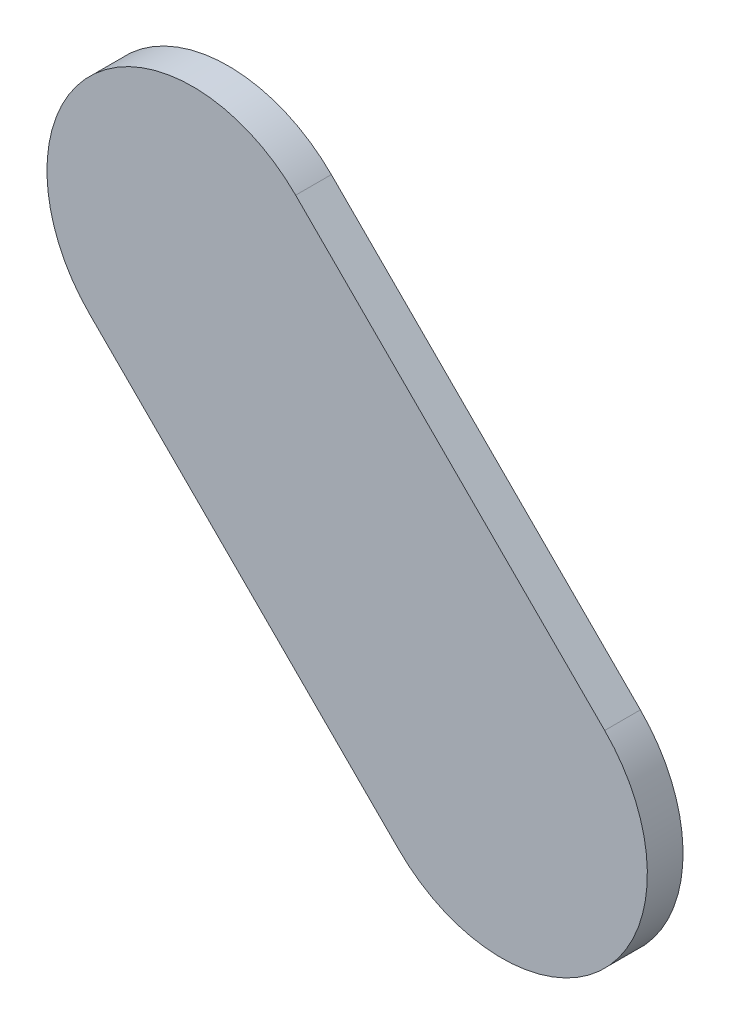
ISO-10303-21;
HEADER;
FILE_DESCRIPTION(('STEP AP214'),'2;1');
FILE_NAME('part.step','',(''),(''),'','','');
FILE_SCHEMA(('AUTOMOTIVE_DESIGN { 1 0 10303 214 1 1 1 1 }'));
ENDSEC;
DATA;
#1=APPLICATION_CONTEXT('core data for automotive mechanical design processes');
#2=APPLICATION_PROTOCOL_DEFINITION('international standard','automotive_design',2000,#1);
#3=PRODUCT_CONTEXT('',#1,'mechanical');
#4=PRODUCT('Part','Part','',(#3));
#5=PRODUCT_RELATED_PRODUCT_CATEGORY('part','',(#4));
#6=PRODUCT_DEFINITION_FORMATION('','',#4);
#7=PRODUCT_DEFINITION_CONTEXT('part definition',#1,'design');
#8=PRODUCT_DEFINITION('design','',#6,#7);
#9=PRODUCT_DEFINITION_SHAPE('','',#8);
#10=(LENGTH_UNIT() NAMED_UNIT(*) SI_UNIT(.MILLI.,.METRE.));
#11=(NAMED_UNIT(*) PLANE_ANGLE_UNIT() SI_UNIT($,.RADIAN.));
#12=(NAMED_UNIT(*) SI_UNIT($,.STERADIAN.) SOLID_ANGLE_UNIT());
#13=UNCERTAINTY_MEASURE_WITH_UNIT(LENGTH_MEASURE(1.E-05),#10,'distance_accuracy_value','');
#14=(GEOMETRIC_REPRESENTATION_CONTEXT(3) GLOBAL_UNCERTAINTY_ASSIGNED_CONTEXT((#13)) GLOBAL_UNIT_ASSIGNED_CONTEXT((#10,
#11,#12)) REPRESENTATION_CONTEXT('',''));
#15=CARTESIAN_POINT('',(0.,0.,0.));
#16=DIRECTION('',(0.,0.,1.));
#17=DIRECTION('',(1.,0.,0.));
#18=AXIS2_PLACEMENT_3D('',#15,#16,#17);
#19=CARTESIAN_POINT('',(7.544305666303,3.860214705288,0.79916));
#20=DIRECTION('',(0.,0.,1.));
#21=DIRECTION('',(1.,0.,0.));
#22=AXIS2_PLACEMENT_3D('',#19,#20,#21);
#23=PLANE('',#22);
#24=CARTESIAN_POINT('',(7.395919667,4.008081101268,0.79916));
#25=DIRECTION('',(0.,0.,1.));
#26=DIRECTION('',(1.,0.,0.));
#27=AXIS2_PLACEMENT_3D('',#24,#25,#26);
#28=CIRCLE('',#27,0.140000470934);
#29=CARTESIAN_POINT('',(7.29692455583352,3.90908611116647,0.79916));
#30=VERTEX_POINT('',#29);
#31=CARTESIAN_POINT('',(7.49491503026737,4.10707630273356,0.79916));
#32=VERTEX_POINT('',#31);
#33=EDGE_CURVE('E20',#30,#32,#28,.F.);
#34=ORIENTED_EDGE('',*,*,#33,.F.);
#35=DIRECTION('',(-0.707107575236102,0.707105987136102,0.));
#36=VECTOR('',#35,1.);
#37=CARTESIAN_POINT('',(7.593909667001,3.612101667001,0.79916));
#38=LINE('',#37,#36);
#39=CARTESIAN_POINT('',(7.59390974790159,3.61210158610059,0.79916));
#40=VERTEX_POINT('',#39);
#41=EDGE_CURVE('E65',#30,#40,#38,.F.);
#42=ORIENTED_EDGE('',*,*,#41,.T.);
#43=CARTESIAN_POINT('',(7.692904667,3.711096,0.79916));
#44=DIRECTION('',(0.,0.,1.));
#45=DIRECTION('',(1.,0.,0.));
#46=AXIS2_PLACEMENT_3D('',#43,#44,#45);
#47=CIRCLE('',#46,0.140000070901);
#48=CARTESIAN_POINT('',(7.79189955533327,3.81009111066628,0.79916));
#49=VERTEX_POINT('',#48);
#50=EDGE_CURVE('E57',#49,#40,#47,.F.);
#51=ORIENTED_EDGE('',*,*,#50,.F.);
#52=DIRECTION('',(0.707105987136602,-0.707107575235602,0.));
#53=VECTOR('',#52,1.);
#54=CARTESIAN_POINT('',(7.494915000001,4.107076333,0.79916));
#55=LINE('',#54,#53);
#56=EDGE_CURVE('E64',#49,#32,#55,.F.);
#57=ORIENTED_EDGE('',*,*,#56,.T.);
#58=EDGE_LOOP('',(#34,#42,#51,#57));
#59=FACE_BOUND('',#58,.T.);
#60=ADVANCED_FACE('F17',(#59),#23,.T.);
#61=CARTESIAN_POINT('',(7.593909667001,3.612101667001,0.76487));
#62=DIRECTION('',(0.707105987136102,0.707107575236102,0.));
#63=DIRECTION('',(-0.707107575236102,0.707105987136102,0.));
#64=AXIS2_PLACEMENT_3D('',#61,#62,#63);
#65=PLANE('',#64);
#66=DIRECTION('',(0.,0.,1.));
#67=VECTOR('',#66,1.);
#68=CARTESIAN_POINT('',(7.29692466699987,3.90908599999987,0.76487));
#69=LINE('',#68,#67);
#70=CARTESIAN_POINT('',(7.2969245558334,3.90908611116628,0.76487));
#71=VERTEX_POINT('',#70);
#72=EDGE_CURVE('E68',#71,#30,#69,.T.);
#73=ORIENTED_EDGE('',*,*,#72,.F.);
#74=DIRECTION('',(-0.707107575236588,0.707105987135615,0.));
#75=VECTOR('',#74,1.);
#76=CARTESIAN_POINT('',(7.593909667001,3.612101667001,0.76487));
#77=LINE('',#76,#75);
#78=CARTESIAN_POINT('',(7.59390974790163,3.61210158610056,0.76487));
#79=VERTEX_POINT('',#78);
#80=EDGE_CURVE('E72',#79,#71,#77,.T.);
#81=ORIENTED_EDGE('',*,*,#80,.F.);
#82=DIRECTION('',(0.,0.,1.));
#83=VECTOR('',#82,1.);
#84=CARTESIAN_POINT('',(7.593909667001,3.612101667001,0.76487));
#85=LINE('',#84,#83);
#86=EDGE_CURVE('E60',#40,#79,#85,.F.);
#87=ORIENTED_EDGE('',*,*,#86,.F.);
#88=ORIENTED_EDGE('',*,*,#41,.F.);
#89=EDGE_LOOP('',(#73,#81,#87,#88));
#90=FACE_BOUND('',#89,.T.);
#91=ADVANCED_FACE('F70',(#90),#65,.F.);
#92=CARTESIAN_POINT('',(7.395919667,4.008081101268,0.76487));
#93=DIRECTION('',(0.,0.,1.));
#94=DIRECTION('',(1.,0.,0.));
#95=AXIS2_PLACEMENT_3D('',#92,#93,#94);
#96=CYLINDRICAL_SURFACE('',#95,0.140000470934);
#97=DIRECTION('',(0.,0.,1.));
#98=VECTOR('',#97,1.);
#99=CARTESIAN_POINT('',(7.494915000001,4.107076333,0.76487));
#100=LINE('',#99,#98);
#101=CARTESIAN_POINT('',(7.49491503026735,4.10707630273358,0.76487));
#102=VERTEX_POINT('',#101);
#103=EDGE_CURVE('E77',#32,#102,#100,.F.);
#104=ORIENTED_EDGE('',*,*,#103,.T.);
#105=CARTESIAN_POINT('',(7.395919333,4.008081333,0.76487));
#106=DIRECTION('',(0.,0.,1.));
#107=DIRECTION('',(1.,0.,0.));
#108=AXIS2_PLACEMENT_3D('',#105,#106,#107);
#109=CIRCLE('',#108,0.140000070901);
#110=EDGE_CURVE('E26',#71,#102,#109,.F.);
#111=ORIENTED_EDGE('',*,*,#110,.F.);
#112=ORIENTED_EDGE('',*,*,#72,.T.);
#113=ORIENTED_EDGE('',*,*,#33,.T.);
#114=EDGE_LOOP('',(#104,#111,#112,#113));
#115=FACE_BOUND('',#114,.T.);
#116=ADVANCED_FACE('F88',(#115),#96,.T.);
#117=CARTESIAN_POINT('',(7.494915000001,4.107076333,0.76487));
#118=DIRECTION('',(-0.707107575235602,-0.707105987136602,0.));
#119=DIRECTION('',(0.707105987136602,-0.707107575235602,0.));
#120=AXIS2_PLACEMENT_3D('',#117,#118,#119);
#121=PLANE('',#120);
#122=DIRECTION('',(0.,0.,1.));
#123=VECTOR('',#122,1.);
#124=CARTESIAN_POINT('',(7.79189933300013,3.81009133300013,0.76487));
#125=LINE('',#124,#123);
#126=CARTESIAN_POINT('',(7.79189955533329,3.81009111066634,0.76487));
#127=VERTEX_POINT('',#126);
#128=EDGE_CURVE('E62',#127,#49,#125,.T.);
#129=ORIENTED_EDGE('',*,*,#128,.F.);
#130=DIRECTION('',(0.707105987136806,-0.707107575235397,0.));
#131=VECTOR('',#130,1.);
#132=CARTESIAN_POINT('',(7.494915000001,4.107076333,0.76487));
#133=LINE('',#132,#131);
#134=EDGE_CURVE('E11',#102,#127,#133,.T.);
#135=ORIENTED_EDGE('',*,*,#134,.F.);
#136=ORIENTED_EDGE('',*,*,#103,.F.);
#137=ORIENTED_EDGE('',*,*,#56,.F.);
#138=EDGE_LOOP('',(#129,#135,#136,#137));
#139=FACE_BOUND('',#138,.T.);
#140=ADVANCED_FACE('F96',(#139),#121,.F.);
#141=CARTESIAN_POINT('',(7.692904667,3.711096,0.76487));
#142=DIRECTION('',(0.,0.,1.));
#143=DIRECTION('',(1.,0.,0.));
#144=AXIS2_PLACEMENT_3D('',#141,#142,#143);
#145=CYLINDRICAL_SURFACE('',#144,0.140000070901);
#146=CARTESIAN_POINT('',(7.692904667001,3.711096565733,0.76487));
#147=DIRECTION('',(0.,0.,1.));
#148=DIRECTION('',(1.,0.,0.));
#149=AXIS2_PLACEMENT_3D('',#146,#147,#148);
#150=CIRCLE('',#149,0.14);
#151=EDGE_CURVE('E35',#127,#79,#150,.F.);
#152=ORIENTED_EDGE('',*,*,#151,.F.);
#153=ORIENTED_EDGE('',*,*,#128,.T.);
#154=ORIENTED_EDGE('',*,*,#50,.T.);
#155=ORIENTED_EDGE('',*,*,#86,.T.);
#156=EDGE_LOOP('',(#152,#153,#154,#155));
#157=FACE_BOUND('',#156,.T.);
#158=ADVANCED_FACE('F58',(#157),#145,.T.);
#159=CARTESIAN_POINT('',(7.544305666303,3.860214705288,0.76487));
#160=DIRECTION('',(0.,0.,-1.));
#161=DIRECTION('',(-1.,0.,0.));
#162=AXIS2_PLACEMENT_3D('',#159,#160,#161);
#163=PLANE('',#162);
#164=ORIENTED_EDGE('',*,*,#134,.T.);
#165=ORIENTED_EDGE('',*,*,#151,.T.);
#166=ORIENTED_EDGE('',*,*,#80,.T.);
#167=ORIENTED_EDGE('',*,*,#110,.T.);
#168=EDGE_LOOP('',(#164,#165,#166,#167));
#169=FACE_BOUND('',#168,.T.);
#170=ADVANCED_FACE('F89',(#169),#163,.T.);
#171=CLOSED_SHELL('',(#60,#91,#116,#140,#158,#170));
#172=MANIFOLD_SOLID_BREP('B1',#171);
#173=ADVANCED_BREP_SHAPE_REPRESENTATION('',(#18,#172),#14);
#174=SHAPE_DEFINITION_REPRESENTATION(#9,#173);
ENDSEC;
END-ISO-10303-21;
